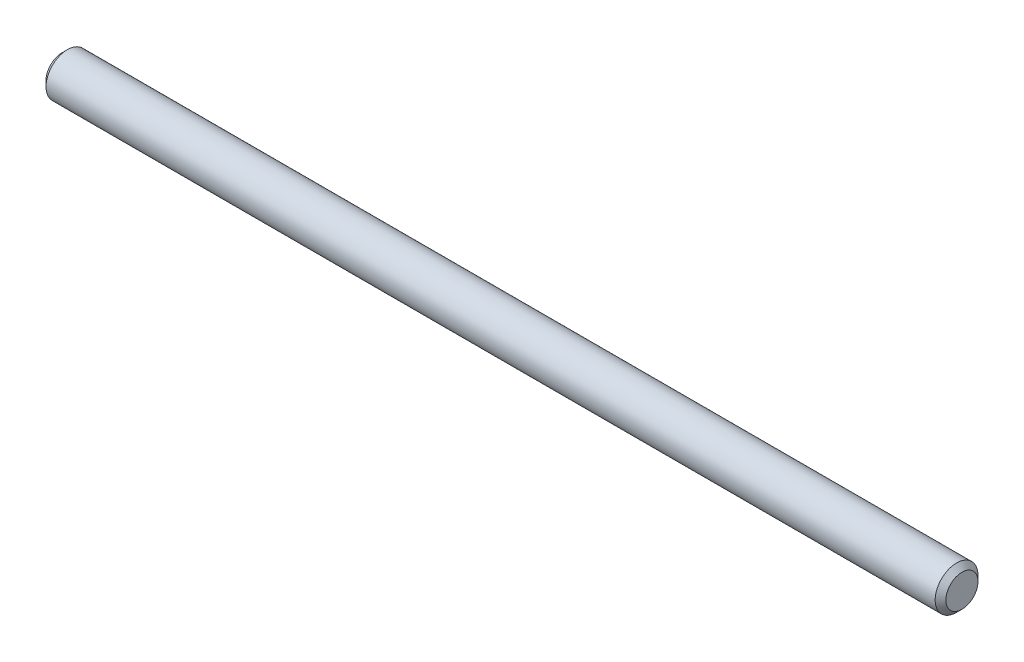
ISO-10303-21;
HEADER;
FILE_DESCRIPTION(('STEP AP214'),'2;1');
FILE_NAME('part.step','',(''),(''),'','','');
FILE_SCHEMA(('AUTOMOTIVE_DESIGN { 1 0 10303 214 1 1 1 1 }'));
ENDSEC;
DATA;
#1=APPLICATION_CONTEXT('core data for automotive mechanical design processes');
#2=APPLICATION_PROTOCOL_DEFINITION('international standard','automotive_design',2000,#1);
#3=PRODUCT_CONTEXT('',#1,'mechanical');
#4=PRODUCT('Part','Part','',(#3));
#5=PRODUCT_RELATED_PRODUCT_CATEGORY('part','',(#4));
#6=PRODUCT_DEFINITION_FORMATION('','',#4);
#7=PRODUCT_DEFINITION_CONTEXT('part definition',#1,'design');
#8=PRODUCT_DEFINITION('design','',#6,#7);
#9=PRODUCT_DEFINITION_SHAPE('','',#8);
#10=(LENGTH_UNIT() NAMED_UNIT(*) SI_UNIT(.MILLI.,.METRE.));
#11=(NAMED_UNIT(*) PLANE_ANGLE_UNIT() SI_UNIT($,.RADIAN.));
#12=(NAMED_UNIT(*) SI_UNIT($,.STERADIAN.) SOLID_ANGLE_UNIT());
#13=UNCERTAINTY_MEASURE_WITH_UNIT(LENGTH_MEASURE(1.E-05),#10,'distance_accuracy_value','');
#14=(GEOMETRIC_REPRESENTATION_CONTEXT(3) GLOBAL_UNCERTAINTY_ASSIGNED_CONTEXT((#13)) GLOBAL_UNIT_ASSIGNED_CONTEXT((#10,
#11,#12)) REPRESENTATION_CONTEXT('',''));
#15=CARTESIAN_POINT('',(0.,0.,0.));
#16=DIRECTION('',(0.,0.,1.));
#17=DIRECTION('',(1.,0.,0.));
#18=AXIS2_PLACEMENT_3D('',#15,#16,#17);
#19=CARTESIAN_POINT('',(84.,0.,0.));
#20=DIRECTION('',(-1.,0.,0.));
#21=DIRECTION('',(0.,0.,1.));
#22=AXIS2_PLACEMENT_3D('',#19,#20,#21);
#23=CYLINDRICAL_SURFACE('',#22,2.);
#24=CARTESIAN_POINT('',(83.5,0.,0.));
#25=DIRECTION('',(1.,0.,0.));
#26=DIRECTION('',(0.,0.,-1.));
#27=AXIS2_PLACEMENT_3D('',#24,#25,#26);
#28=CIRCLE('',#27,2.);
#29=CARTESIAN_POINT('',(83.5,0.,-2.));
#30=VERTEX_POINT('',#29);
#31=EDGE_CURVE('E49',#30,#30,#28,.F.);
#32=ORIENTED_EDGE('',*,*,#31,.T.);
#33=EDGE_LOOP('',(#32));
#34=FACE_BOUND('',#33,.T.);
#35=CARTESIAN_POINT('',(0.500000000000042,0.,0.));
#36=DIRECTION('',(1.,0.,0.));
#37=DIRECTION('',(0.,0.,-1.));
#38=AXIS2_PLACEMENT_3D('',#35,#36,#37);
#39=CIRCLE('',#38,2.);
#40=CARTESIAN_POINT('',(0.500000000000042,0.,-2.));
#41=VERTEX_POINT('',#40);
#42=EDGE_CURVE('E54',#41,#41,#39,.T.);
#43=ORIENTED_EDGE('',*,*,#42,.T.);
#44=EDGE_LOOP('',(#43));
#45=FACE_BOUND('',#44,.T.);
#46=ADVANCED_FACE('F41',(#34,#45),#23,.T.);
#47=CARTESIAN_POINT('',(84.,0.,0.));
#48=DIRECTION('',(1.,0.,0.));
#49=DIRECTION('',(0.,0.,-1.));
#50=AXIS2_PLACEMENT_3D('',#47,#48,#49);
#51=PLANE('',#50);
#52=CARTESIAN_POINT('',(84.,0.,0.));
#53=DIRECTION('',(1.,0.,0.));
#54=DIRECTION('',(0.,0.,-1.));
#55=AXIS2_PLACEMENT_3D('',#52,#53,#54);
#56=CIRCLE('',#55,1.50000000000003);
#57=CARTESIAN_POINT('',(84.,0.,-1.50000000000003));
#58=VERTEX_POINT('',#57);
#59=EDGE_CURVE('E59',#58,#58,#56,.T.);
#60=ORIENTED_EDGE('',*,*,#59,.T.);
#61=EDGE_LOOP('',(#60));
#62=FACE_BOUND('',#61,.T.);
#63=ADVANCED_FACE('F66',(#62),#51,.T.);
#64=CARTESIAN_POINT('',(0.,0.,0.));
#65=DIRECTION('',(1.,0.,0.));
#66=DIRECTION('',(0.,0.,-1.));
#67=AXIS2_PLACEMENT_3D('',#64,#65,#66);
#68=PLANE('',#67);
#69=CARTESIAN_POINT('',(0.,0.,0.));
#70=DIRECTION('',(1.,0.,0.));
#71=DIRECTION('',(0.,0.,-1.));
#72=AXIS2_PLACEMENT_3D('',#69,#70,#71);
#73=CIRCLE('',#72,1.49999999999995);
#74=CARTESIAN_POINT('',(0.,0.,-1.49999999999995));
#75=VERTEX_POINT('',#74);
#76=EDGE_CURVE('E10',#75,#75,#73,.F.);
#77=ORIENTED_EDGE('',*,*,#76,.T.);
#78=EDGE_LOOP('',(#77));
#79=FACE_BOUND('',#78,.T.);
#80=ADVANCED_FACE('F70',(#79),#68,.F.);
#81=CARTESIAN_POINT('',(84.,0.,0.));
#82=DIRECTION('',(-1.,0.,0.));
#83=DIRECTION('',(0.,0.,1.));
#84=AXIS2_PLACEMENT_3D('',#81,#82,#83);
#85=CONICAL_SURFACE('',#84,1.50000000000003,0.785398163397449);
#86=ORIENTED_EDGE('',*,*,#31,.F.);
#87=EDGE_LOOP('',(#86));
#88=FACE_BOUND('',#87,.T.);
#89=ORIENTED_EDGE('',*,*,#59,.F.);
#90=EDGE_LOOP('',(#89));
#91=FACE_BOUND('',#90,.T.);
#92=ADVANCED_FACE('F68',(#88,#91),#85,.T.);
#93=CARTESIAN_POINT('',(0.500000000000042,0.,0.));
#94=DIRECTION('',(1.,0.,0.));
#95=DIRECTION('',(0.,0.,-1.));
#96=AXIS2_PLACEMENT_3D('',#93,#94,#95);
#97=CONICAL_SURFACE('',#96,2.,0.785398163397456);
#98=ORIENTED_EDGE('',*,*,#76,.F.);
#99=EDGE_LOOP('',(#98));
#100=FACE_BOUND('',#99,.T.);
#101=ORIENTED_EDGE('',*,*,#42,.F.);
#102=EDGE_LOOP('',(#101));
#103=FACE_BOUND('',#102,.T.);
#104=ADVANCED_FACE('F43',(#100,#103),#97,.T.);
#105=CLOSED_SHELL('',(#46,#63,#80,#92,#104));
#106=MANIFOLD_SOLID_BREP('B2',#105);
#107=ADVANCED_BREP_SHAPE_REPRESENTATION('',(#18,#106),#14);
#108=SHAPE_DEFINITION_REPRESENTATION(#9,#107);
ENDSEC;
END-ISO-10303-21;
